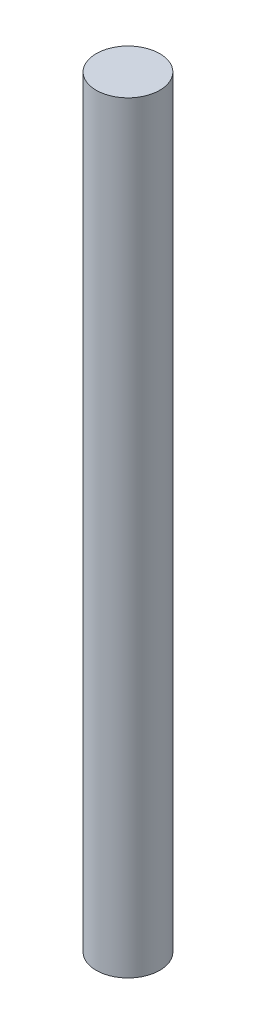
ISO-10303-21;
HEADER;
FILE_DESCRIPTION(('STEP AP214'),'2;1');
FILE_NAME('part.step','',(''),(''),'','','');
FILE_SCHEMA(('AUTOMOTIVE_DESIGN { 1 0 10303 214 1 1 1 1 }'));
ENDSEC;
DATA;
#1=APPLICATION_CONTEXT('core data for automotive mechanical design processes');
#2=APPLICATION_PROTOCOL_DEFINITION('international standard','automotive_design',2000,#1);
#3=PRODUCT_CONTEXT('',#1,'mechanical');
#4=PRODUCT('Part','Part','',(#3));
#5=PRODUCT_RELATED_PRODUCT_CATEGORY('part','',(#4));
#6=PRODUCT_DEFINITION_FORMATION('','',#4);
#7=PRODUCT_DEFINITION_CONTEXT('part definition',#1,'design');
#8=PRODUCT_DEFINITION('design','',#6,#7);
#9=PRODUCT_DEFINITION_SHAPE('','',#8);
#10=(LENGTH_UNIT() NAMED_UNIT(*) SI_UNIT(.MILLI.,.METRE.));
#11=(NAMED_UNIT(*) PLANE_ANGLE_UNIT() SI_UNIT($,.RADIAN.));
#12=(NAMED_UNIT(*) SI_UNIT($,.STERADIAN.) SOLID_ANGLE_UNIT());
#13=UNCERTAINTY_MEASURE_WITH_UNIT(LENGTH_MEASURE(1.E-05),#10,'distance_accuracy_value','');
#14=(GEOMETRIC_REPRESENTATION_CONTEXT(3) GLOBAL_UNCERTAINTY_ASSIGNED_CONTEXT((#13)) GLOBAL_UNIT_ASSIGNED_CONTEXT((#10,
#11,#12)) REPRESENTATION_CONTEXT('',''));
#15=CARTESIAN_POINT('',(0.,0.,0.));
#16=DIRECTION('',(0.,0.,1.));
#17=DIRECTION('',(1.,0.,0.));
#18=AXIS2_PLACEMENT_3D('',#15,#16,#17);
#19=CARTESIAN_POINT('',(0.,304.8,0.));
#20=DIRECTION('',(0.,-1.,0.));
#21=DIRECTION('',(0.,0.,-1.));
#22=AXIS2_PLACEMENT_3D('',#19,#20,#21);
#23=CYLINDRICAL_SURFACE('',#22,12.7);
#24=CARTESIAN_POINT('',(0.,304.8,0.));
#25=DIRECTION('',(0.,1.,0.));
#26=DIRECTION('',(0.,0.,1.));
#27=AXIS2_PLACEMENT_3D('',#24,#25,#26);
#28=CIRCLE('',#27,12.7);
#29=CARTESIAN_POINT('',(0.,304.8,12.7));
#30=VERTEX_POINT('',#29);
#31=EDGE_CURVE('E10',#30,#30,#28,.T.);
#32=ORIENTED_EDGE('',*,*,#31,.F.);
#33=EDGE_LOOP('',(#32));
#34=FACE_BOUND('',#33,.T.);
#35=CARTESIAN_POINT('',(0.,0.,0.));
#36=DIRECTION('',(0.,1.,0.));
#37=DIRECTION('',(0.,0.,1.));
#38=AXIS2_PLACEMENT_3D('',#35,#36,#37);
#39=CIRCLE('',#38,12.7);
#40=CARTESIAN_POINT('',(0.,0.,12.7));
#41=VERTEX_POINT('',#40);
#42=EDGE_CURVE('E35',#41,#41,#39,.T.);
#43=ORIENTED_EDGE('',*,*,#42,.T.);
#44=EDGE_LOOP('',(#43));
#45=FACE_BOUND('',#44,.T.);
#46=ADVANCED_FACE('F32',(#34,#45),#23,.T.);
#47=CARTESIAN_POINT('',(0.,304.8,0.));
#48=DIRECTION('',(0.,1.,0.));
#49=DIRECTION('',(0.,0.,1.));
#50=AXIS2_PLACEMENT_3D('',#47,#48,#49);
#51=PLANE('',#50);
#52=ORIENTED_EDGE('',*,*,#31,.T.);
#53=EDGE_LOOP('',(#52));
#54=FACE_BOUND('',#53,.T.);
#55=ADVANCED_FACE('F47',(#54),#51,.T.);
#56=CARTESIAN_POINT('',(0.,0.,0.));
#57=DIRECTION('',(0.,1.,0.));
#58=DIRECTION('',(0.,0.,1.));
#59=AXIS2_PLACEMENT_3D('',#56,#57,#58);
#60=PLANE('',#59);
#61=ORIENTED_EDGE('',*,*,#42,.F.);
#62=EDGE_LOOP('',(#61));
#63=FACE_BOUND('',#62,.T.);
#64=ADVANCED_FACE('F45',(#63),#60,.F.);
#65=CLOSED_SHELL('',(#46,#55,#64));
#66=MANIFOLD_SOLID_BREP('B2',#65);
#67=ADVANCED_BREP_SHAPE_REPRESENTATION('',(#18,#66),#14);
#68=SHAPE_DEFINITION_REPRESENTATION(#9,#67);
ENDSEC;
END-ISO-10303-21;
